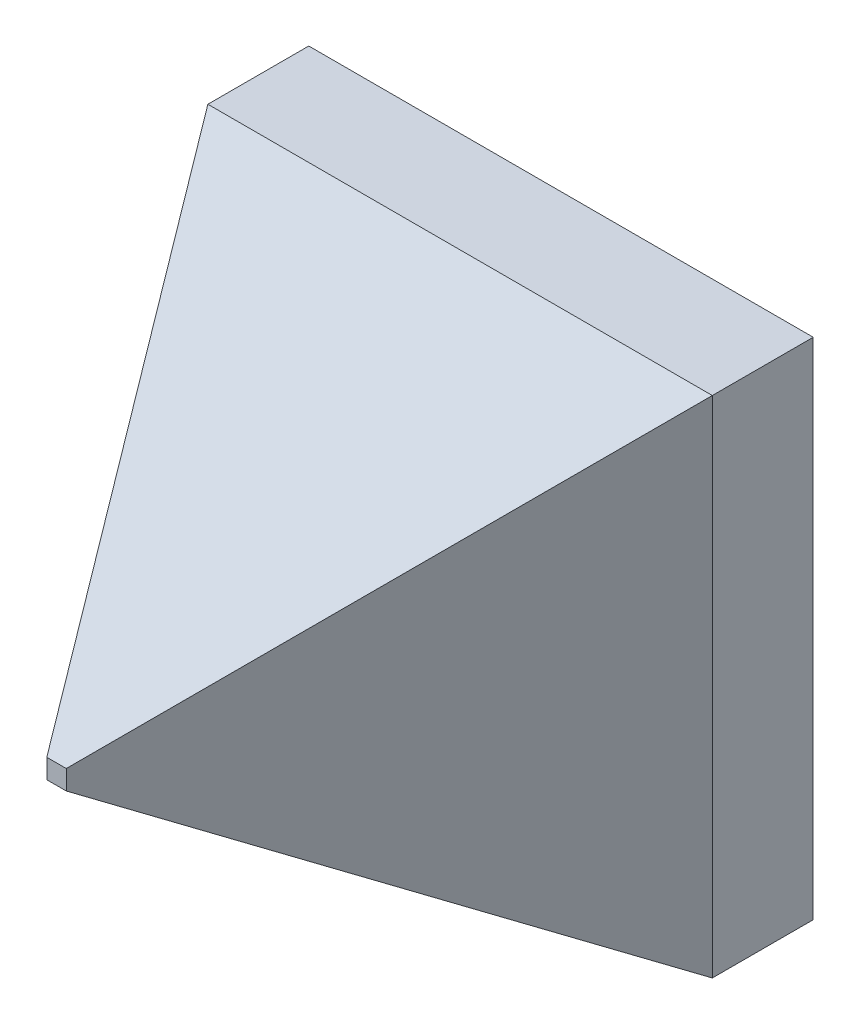
ISO-10303-21;
HEADER;
FILE_DESCRIPTION(('STEP AP214'),'2;1');
FILE_NAME('part.step','',(''),(''),'','','');
FILE_SCHEMA(('AUTOMOTIVE_DESIGN { 1 0 10303 214 1 1 1 1 }'));
ENDSEC;
DATA;
#1=APPLICATION_CONTEXT('core data for automotive mechanical design processes');
#2=APPLICATION_PROTOCOL_DEFINITION('international standard','automotive_design',2000,#1);
#3=PRODUCT_CONTEXT('',#1,'mechanical');
#4=PRODUCT('Part','Part','',(#3));
#5=PRODUCT_RELATED_PRODUCT_CATEGORY('part','',(#4));
#6=PRODUCT_DEFINITION_FORMATION('','',#4);
#7=PRODUCT_DEFINITION_CONTEXT('part definition',#1,'design');
#8=PRODUCT_DEFINITION('design','',#6,#7);
#9=PRODUCT_DEFINITION_SHAPE('','',#8);
#10=(LENGTH_UNIT() NAMED_UNIT(*) SI_UNIT(.MILLI.,.METRE.));
#11=(NAMED_UNIT(*) PLANE_ANGLE_UNIT() SI_UNIT($,.RADIAN.));
#12=(NAMED_UNIT(*) SI_UNIT($,.STERADIAN.) SOLID_ANGLE_UNIT());
#13=UNCERTAINTY_MEASURE_WITH_UNIT(LENGTH_MEASURE(1.E-05),#10,'distance_accuracy_value','');
#14=(GEOMETRIC_REPRESENTATION_CONTEXT(3) GLOBAL_UNCERTAINTY_ASSIGNED_CONTEXT((#13)) GLOBAL_UNIT_ASSIGNED_CONTEXT((#10,
#11,#12)) REPRESENTATION_CONTEXT('',''));
#15=CARTESIAN_POINT('',(0.,0.,0.));
#16=DIRECTION('',(0.,0.,1.));
#17=DIRECTION('',(1.,0.,0.));
#18=AXIS2_PLACEMENT_3D('',#15,#16,#17);
#19=CARTESIAN_POINT('',(25.,-25.,-10.));
#20=DIRECTION('',(1.,0.,0.));
#21=DIRECTION('',(0.,0.,-1.));
#22=AXIS2_PLACEMENT_3D('',#19,#20,#21);
#23=PLANE('',#22);
#24=DIRECTION('',(0.,1.,0.));
#25=VECTOR('',#24,1.);
#26=CARTESIAN_POINT('',(25.,-25.,0.));
#27=LINE('',#26,#25);
#28=CARTESIAN_POINT('',(25.,-25.,0.));
#29=VERTEX_POINT('',#28);
#30=CARTESIAN_POINT('',(25.,25.,0.));
#31=VERTEX_POINT('',#30);
#32=EDGE_CURVE('E89',#29,#31,#27,.T.);
#33=ORIENTED_EDGE('',*,*,#32,.F.);
#34=DIRECTION('',(0.,0.,1.));
#35=VECTOR('',#34,1.);
#36=CARTESIAN_POINT('',(25.,-25.,-10.));
#37=LINE('',#36,#35);
#38=CARTESIAN_POINT('',(25.,-25.,-10.));
#39=VERTEX_POINT('',#38);
#40=EDGE_CURVE('E11',#39,#29,#37,.T.);
#41=ORIENTED_EDGE('',*,*,#40,.F.);
#42=DIRECTION('',(0.,1.,0.));
#43=VECTOR('',#42,1.);
#44=CARTESIAN_POINT('',(25.,-25.,-10.));
#45=LINE('',#44,#43);
#46=CARTESIAN_POINT('',(25.,25.,-10.));
#47=VERTEX_POINT('',#46);
#48=EDGE_CURVE('E113',#39,#47,#45,.T.);
#49=ORIENTED_EDGE('',*,*,#48,.T.);
#50=DIRECTION('',(0.,0.,1.));
#51=VECTOR('',#50,1.);
#52=CARTESIAN_POINT('',(25.,25.,-10.));
#53=LINE('',#52,#51);
#54=EDGE_CURVE('E36',#47,#31,#53,.T.);
#55=ORIENTED_EDGE('',*,*,#54,.T.);
#56=EDGE_LOOP('',(#33,#41,#49,#55));
#57=FACE_BOUND('',#56,.T.);
#58=ADVANCED_FACE('F33',(#57),#23,.T.);
#59=CARTESIAN_POINT('',(-25.,-25.,-10.));
#60=DIRECTION('',(0.,-1.,0.));
#61=DIRECTION('',(0.,0.,-1.));
#62=AXIS2_PLACEMENT_3D('',#59,#60,#61);
#63=PLANE('',#62);
#64=DIRECTION('',(1.,0.,0.));
#65=VECTOR('',#64,1.);
#66=CARTESIAN_POINT('',(-25.,-25.,0.));
#67=LINE('',#66,#65);
#68=CARTESIAN_POINT('',(-25.,-25.,0.));
#69=VERTEX_POINT('',#68);
#70=EDGE_CURVE('E100',#69,#29,#67,.T.);
#71=ORIENTED_EDGE('',*,*,#70,.F.);
#72=DIRECTION('',(0.,0.,1.));
#73=VECTOR('',#72,1.);
#74=CARTESIAN_POINT('',(-25.,-25.,-10.));
#75=LINE('',#74,#73);
#76=CARTESIAN_POINT('',(-25.,-25.,-10.));
#77=VERTEX_POINT('',#76);
#78=EDGE_CURVE('E42',#77,#69,#75,.T.);
#79=ORIENTED_EDGE('',*,*,#78,.F.);
#80=DIRECTION('',(1.,0.,0.));
#81=VECTOR('',#80,1.);
#82=CARTESIAN_POINT('',(-25.,-25.,-10.));
#83=LINE('',#82,#81);
#84=EDGE_CURVE('E103',#77,#39,#83,.T.);
#85=ORIENTED_EDGE('',*,*,#84,.T.);
#86=ORIENTED_EDGE('',*,*,#40,.T.);
#87=EDGE_LOOP('',(#71,#79,#85,#86));
#88=FACE_BOUND('',#87,.T.);
#89=ADVANCED_FACE('F99',(#88),#63,.T.);
#90=CARTESIAN_POINT('',(-25.,-25.,-10.));
#91=DIRECTION('',(-1.,0.,0.));
#92=DIRECTION('',(0.,0.,1.));
#93=AXIS2_PLACEMENT_3D('',#90,#91,#92);
#94=PLANE('',#93);
#95=DIRECTION('',(0.,-1.,0.));
#96=VECTOR('',#95,1.);
#97=CARTESIAN_POINT('',(-25.,-25.,0.));
#98=LINE('',#97,#96);
#99=CARTESIAN_POINT('',(-25.,25.,0.));
#100=VERTEX_POINT('',#99);
#101=EDGE_CURVE('E114',#100,#69,#98,.T.);
#102=ORIENTED_EDGE('',*,*,#101,.F.);
#103=DIRECTION('',(0.,0.,1.));
#104=VECTOR('',#103,1.);
#105=CARTESIAN_POINT('',(-25.,25.,-10.));
#106=LINE('',#105,#104);
#107=CARTESIAN_POINT('',(-25.,25.,-10.));
#108=VERTEX_POINT('',#107);
#109=EDGE_CURVE('E65',#108,#100,#106,.T.);
#110=ORIENTED_EDGE('',*,*,#109,.F.);
#111=DIRECTION('',(0.,-1.,0.));
#112=VECTOR('',#111,1.);
#113=CARTESIAN_POINT('',(-25.,-25.,-10.));
#114=LINE('',#113,#112);
#115=EDGE_CURVE('E136',#108,#77,#114,.T.);
#116=ORIENTED_EDGE('',*,*,#115,.T.);
#117=ORIENTED_EDGE('',*,*,#78,.T.);
#118=EDGE_LOOP('',(#102,#110,#116,#117));
#119=FACE_BOUND('',#118,.T.);
#120=ADVANCED_FACE('F146',(#119),#94,.T.);
#121=CARTESIAN_POINT('',(-25.,25.,-10.));
#122=DIRECTION('',(0.,1.,0.));
#123=DIRECTION('',(0.,0.,1.));
#124=AXIS2_PLACEMENT_3D('',#121,#122,#123);
#125=PLANE('',#124);
#126=DIRECTION('',(-1.,0.,0.));
#127=VECTOR('',#126,1.);
#128=CARTESIAN_POINT('',(-25.,25.,0.));
#129=LINE('',#128,#127);
#130=EDGE_CURVE('E93',#31,#100,#129,.T.);
#131=ORIENTED_EDGE('',*,*,#130,.F.);
#132=ORIENTED_EDGE('',*,*,#54,.F.);
#133=DIRECTION('',(-1.,0.,0.));
#134=VECTOR('',#133,1.);
#135=CARTESIAN_POINT('',(-25.,25.,-10.));
#136=LINE('',#135,#134);
#137=EDGE_CURVE('E134',#47,#108,#136,.T.);
#138=ORIENTED_EDGE('',*,*,#137,.T.);
#139=ORIENTED_EDGE('',*,*,#109,.T.);
#140=EDGE_LOOP('',(#131,#132,#138,#139));
#141=FACE_BOUND('',#140,.T.);
#142=ADVANCED_FACE('F151',(#141),#125,.T.);
#143=CARTESIAN_POINT('',(0.,0.,-10.));
#144=DIRECTION('',(0.,0.,-1.));
#145=DIRECTION('',(-1.,0.,0.));
#146=AXIS2_PLACEMENT_3D('',#143,#144,#145);
#147=PLANE('',#146);
#148=ORIENTED_EDGE('',*,*,#48,.F.);
#149=ORIENTED_EDGE('',*,*,#84,.F.);
#150=ORIENTED_EDGE('',*,*,#115,.F.);
#151=ORIENTED_EDGE('',*,*,#137,.F.);
#152=EDGE_LOOP('',(#148,#149,#150,#151));
#153=FACE_BOUND('',#152,.T.);
#154=ADVANCED_FACE('F153',(#153),#147,.T.);
#155=CARTESIAN_POINT('',(25.,-25.,0.));
#156=DIRECTION('',(0.857167300702112,0.,0.515038074910055));
#157=DIRECTION('',(0.515038074910055,0.,-0.857167300702112));
#158=AXIS2_PLACEMENT_3D('',#155,#156,#157);
#159=PLANE('',#158);
#160=ORIENTED_EDGE('',*,*,#32,.T.);
#161=DIRECTION('',(0.457876888408291,0.457876888408291,-0.762035110820416));
#162=VECTOR('',#161,1.);
#163=CARTESIAN_POINT('',(14.5174377530771,14.5174377530771,17.4459132700159));
#164=LINE('',#163,#162);
#165=CARTESIAN_POINT('',(0.965575238897554,0.965575238897558,40.));
#166=VERTEX_POINT('',#165);
#167=EDGE_CURVE('E94',#166,#31,#164,.T.);
#168=ORIENTED_EDGE('',*,*,#167,.F.);
#169=DIRECTION('',(0.,-1.,0.));
#170=VECTOR('',#169,1.);
#171=CARTESIAN_POINT('',(0.965575238897554,0.,40.));
#172=LINE('',#171,#170);
#173=CARTESIAN_POINT('',(0.965575238897554,-0.965575238897558,40.));
#174=VERTEX_POINT('',#173);
#175=EDGE_CURVE('E118',#174,#166,#172,.F.);
#176=ORIENTED_EDGE('',*,*,#175,.F.);
#177=DIRECTION('',(0.457876888408291,-0.457876888408291,-0.762035110820416));
#178=VECTOR('',#177,1.);
#179=CARTESIAN_POINT('',(25.,-25.,0.));
#180=LINE('',#179,#178);
#181=EDGE_CURVE('E109',#174,#29,#180,.T.);
#182=ORIENTED_EDGE('',*,*,#181,.T.);
#183=EDGE_LOOP('',(#160,#168,#176,#182));
#184=FACE_BOUND('',#183,.T.);
#185=ADVANCED_FACE('F116',(#184),#159,.T.);
#186=CARTESIAN_POINT('',(-25.,25.,0.));
#187=DIRECTION('',(0.,0.857167300702112,0.515038074910055));
#188=DIRECTION('',(0.,-0.515038074910055,0.857167300702112));
#189=AXIS2_PLACEMENT_3D('',#186,#187,#188);
#190=PLANE('',#189);
#191=ORIENTED_EDGE('',*,*,#130,.T.);
#192=DIRECTION('',(-0.457876888408291,0.457876888408291,-0.762035110820416));
#193=VECTOR('',#192,1.);
#194=CARTESIAN_POINT('',(-14.5174377530771,14.5174377530771,17.445913270016));
#195=LINE('',#194,#193);
#196=CARTESIAN_POINT('',(-0.965575238897554,0.965575238897558,40.));
#197=VERTEX_POINT('',#196);
#198=EDGE_CURVE('E121',#197,#100,#195,.T.);
#199=ORIENTED_EDGE('',*,*,#198,.F.);
#200=DIRECTION('',(1.,0.,0.));
#201=VECTOR('',#200,1.);
#202=CARTESIAN_POINT('',(0.,0.965575238897555,40.));
#203=LINE('',#202,#201);
#204=EDGE_CURVE('E130',#166,#197,#203,.F.);
#205=ORIENTED_EDGE('',*,*,#204,.F.);
#206=ORIENTED_EDGE('',*,*,#167,.T.);
#207=EDGE_LOOP('',(#191,#199,#205,#206));
#208=FACE_BOUND('',#207,.T.);
#209=ADVANCED_FACE('F150',(#208),#190,.T.);
#210=CARTESIAN_POINT('',(-25.,-25.,0.));
#211=DIRECTION('',(-0.857167300702112,0.,0.515038074910055));
#212=DIRECTION('',(0.515038074910055,0.,0.857167300702112));
#213=AXIS2_PLACEMENT_3D('',#210,#211,#212);
#214=PLANE('',#213);
#215=ORIENTED_EDGE('',*,*,#101,.T.);
#216=DIRECTION('',(-0.457876888408291,-0.457876888408291,-0.762035110820416));
#217=VECTOR('',#216,1.);
#218=CARTESIAN_POINT('',(-25.,-25.,0.));
#219=LINE('',#218,#217);
#220=CARTESIAN_POINT('',(-0.965575238897554,-0.965575238897558,40.));
#221=VERTEX_POINT('',#220);
#222=EDGE_CURVE('E112',#221,#69,#219,.T.);
#223=ORIENTED_EDGE('',*,*,#222,.F.);
#224=DIRECTION('',(0.,1.,0.));
#225=VECTOR('',#224,1.);
#226=CARTESIAN_POINT('',(-0.965575238897554,0.,40.));
#227=LINE('',#226,#225);
#228=EDGE_CURVE('E123',#197,#221,#227,.F.);
#229=ORIENTED_EDGE('',*,*,#228,.F.);
#230=ORIENTED_EDGE('',*,*,#198,.T.);
#231=EDGE_LOOP('',(#215,#223,#229,#230));
#232=FACE_BOUND('',#231,.T.);
#233=ADVANCED_FACE('F143',(#232),#214,.T.);
#234=CARTESIAN_POINT('',(-25.,-25.,0.));
#235=DIRECTION('',(0.,-0.857167300702112,0.515038074910055));
#236=DIRECTION('',(0.,-0.515038074910055,-0.857167300702112));
#237=AXIS2_PLACEMENT_3D('',#234,#235,#236);
#238=PLANE('',#237);
#239=ORIENTED_EDGE('',*,*,#70,.T.);
#240=ORIENTED_EDGE('',*,*,#181,.F.);
#241=DIRECTION('',(-1.,0.,0.));
#242=VECTOR('',#241,1.);
#243=CARTESIAN_POINT('',(0.,-0.965575238897555,40.));
#244=LINE('',#243,#242);
#245=EDGE_CURVE('E119',#221,#174,#244,.F.);
#246=ORIENTED_EDGE('',*,*,#245,.F.);
#247=ORIENTED_EDGE('',*,*,#222,.T.);
#248=EDGE_LOOP('',(#239,#240,#246,#247));
#249=FACE_BOUND('',#248,.T.);
#250=ADVANCED_FACE('F107',(#249),#238,.T.);
#251=CARTESIAN_POINT('',(0.,0.,40.));
#252=DIRECTION('',(0.,0.,-1.));
#253=DIRECTION('',(-1.,0.,0.));
#254=AXIS2_PLACEMENT_3D('',#251,#252,#253);
#255=PLANE('',#254);
#256=ORIENTED_EDGE('',*,*,#175,.T.);
#257=ORIENTED_EDGE('',*,*,#204,.T.);
#258=ORIENTED_EDGE('',*,*,#228,.T.);
#259=ORIENTED_EDGE('',*,*,#245,.T.);
#260=EDGE_LOOP('',(#256,#257,#258,#259));
#261=FACE_BOUND('',#260,.T.);
#262=ADVANCED_FACE('F175',(#261),#255,.F.);
#263=CLOSED_SHELL('',(#58,#89,#120,#142,#154,#185,#209,#233,#250,#262));
#264=MANIFOLD_SOLID_BREP('B2',#263);
#265=ADVANCED_BREP_SHAPE_REPRESENTATION('',(#18,#264),#14);
#266=SHAPE_DEFINITION_REPRESENTATION(#9,#265);
ENDSEC;
END-ISO-10303-21;
